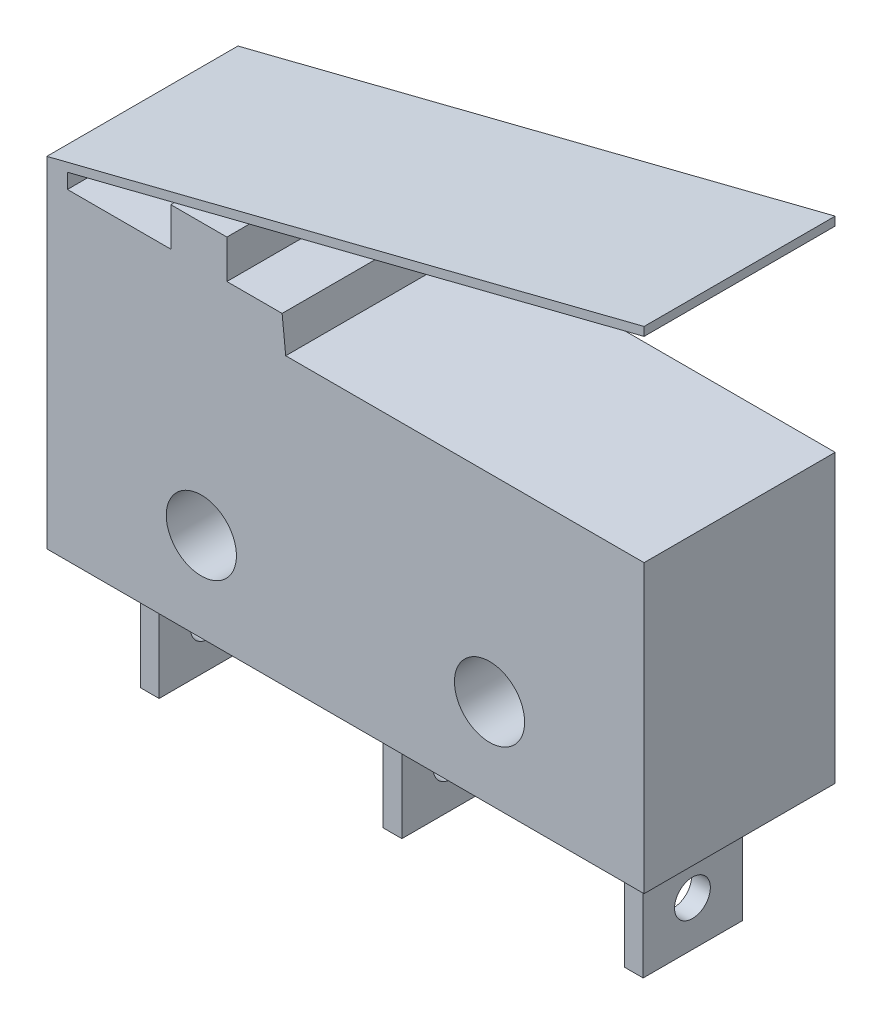
ISO-10303-21;
HEADER;
FILE_DESCRIPTION(('STEP AP214'),'2;1');
FILE_NAME('part.step','',(''),(''),'','','');
FILE_SCHEMA(('AUTOMOTIVE_DESIGN { 1 0 10303 214 1 1 1 1 }'));
ENDSEC;
DATA;
#1=APPLICATION_CONTEXT('core data for automotive mechanical design processes');
#2=APPLICATION_PROTOCOL_DEFINITION('international standard','automotive_design',2000,#1);
#3=PRODUCT_CONTEXT('',#1,'mechanical');
#4=PRODUCT('Part','Part','',(#3));
#5=PRODUCT_RELATED_PRODUCT_CATEGORY('part','',(#4));
#6=PRODUCT_DEFINITION_FORMATION('','',#4);
#7=PRODUCT_DEFINITION_CONTEXT('part definition',#1,'design');
#8=PRODUCT_DEFINITION('design','',#6,#7);
#9=PRODUCT_DEFINITION_SHAPE('','',#8);
#10=(LENGTH_UNIT() NAMED_UNIT(*) SI_UNIT(.MILLI.,.METRE.));
#11=(NAMED_UNIT(*) PLANE_ANGLE_UNIT() SI_UNIT($,.RADIAN.));
#12=(NAMED_UNIT(*) SI_UNIT($,.STERADIAN.) SOLID_ANGLE_UNIT());
#13=UNCERTAINTY_MEASURE_WITH_UNIT(LENGTH_MEASURE(1.E-05),#10,'distance_accuracy_value','');
#14=(GEOMETRIC_REPRESENTATION_CONTEXT(3) GLOBAL_UNCERTAINTY_ASSIGNED_CONTEXT((#13)) GLOBAL_UNIT_ASSIGNED_CONTEXT((#10,
#11,#12)) REPRESENTATION_CONTEXT('',''));
#15=CARTESIAN_POINT('',(0.,0.,0.));
#16=DIRECTION('',(0.,0.,1.));
#17=DIRECTION('',(1.,0.,0.));
#18=AXIS2_PLACEMENT_3D('',#15,#16,#17);
#19=CARTESIAN_POINT('',(1.36184855369967,21.0415924582425,6.4));
#20=DIRECTION('',(0.,1.,0.));
#21=DIRECTION('',(0.,0.,1.));
#22=AXIS2_PLACEMENT_3D('',#19,#20,#21);
#23=PLANE('',#22);
#24=DIRECTION('',(0.,0.,-1.));
#25=VECTOR('',#24,1.);
#26=CARTESIAN_POINT('',(11.0718485536997,21.0415924582425,1.52));
#27=LINE('',#26,#25);
#28=CARTESIAN_POINT('',(11.0718485536997,21.0415924582425,4.85));
#29=VERTEX_POINT('',#28);
#30=CARTESIAN_POINT('',(11.0718485536997,21.0415924582425,1.52));
#31=VERTEX_POINT('',#30);
#32=EDGE_CURVE('E229',#29,#31,#27,.T.);
#33=ORIENTED_EDGE('',*,*,#32,.F.);
#34=DIRECTION('',(-1.,0.,0.));
#35=VECTOR('',#34,1.);
#36=CARTESIAN_POINT('',(11.0718485536997,21.0415924582425,4.85));
#37=LINE('',#36,#35);
#38=CARTESIAN_POINT('',(11.7018485536997,21.0415924582425,4.85));
#39=VERTEX_POINT('',#38);
#40=EDGE_CURVE('E242',#39,#29,#37,.T.);
#41=ORIENTED_EDGE('',*,*,#40,.F.);
#42=DIRECTION('',(0.,0.,1.));
#43=VECTOR('',#42,1.);
#44=CARTESIAN_POINT('',(11.7018485536997,21.0415924582425,1.52));
#45=LINE('',#44,#43);
#46=CARTESIAN_POINT('',(11.7018485536997,21.0415924582425,1.52));
#47=VERTEX_POINT('',#46);
#48=EDGE_CURVE('E251',#47,#39,#45,.T.);
#49=ORIENTED_EDGE('',*,*,#48,.F.);
#50=DIRECTION('',(1.,0.,0.));
#51=VECTOR('',#50,1.);
#52=CARTESIAN_POINT('',(11.0718485536997,21.0415924582425,1.52));
#53=LINE('',#52,#51);
#54=EDGE_CURVE('E232',#31,#47,#53,.T.);
#55=ORIENTED_EDGE('',*,*,#54,.F.);
#56=EDGE_LOOP('',(#33,#41,#49,#55));
#57=FACE_BOUND('',#56,.T.);
#58=DIRECTION('',(1.,0.,0.));
#59=VECTOR('',#58,1.);
#60=CARTESIAN_POINT('',(1.36184855369967,21.0415924582425,0.));
#61=LINE('',#60,#59);
#62=CARTESIAN_POINT('',(1.36184855369967,21.0415924582425,0.));
#63=VERTEX_POINT('',#62);
#64=CARTESIAN_POINT('',(21.3618485536997,21.0415924582425,0.));
#65=VERTEX_POINT('',#64);
#66=EDGE_CURVE('E416',#63,#65,#61,.T.);
#67=ORIENTED_EDGE('',*,*,#66,.T.);
#68=DIRECTION('',(0.,0.,-1.));
#69=VECTOR('',#68,1.);
#70=CARTESIAN_POINT('',(21.3618485536997,21.0415924582425,6.4));
#71=LINE('',#70,#69);
#72=CARTESIAN_POINT('',(21.3618485536997,21.0415924582425,6.4));
#73=VERTEX_POINT('',#72);
#74=EDGE_CURVE('E42',#73,#65,#71,.T.);
#75=ORIENTED_EDGE('',*,*,#74,.F.);
#76=DIRECTION('',(1.,0.,0.));
#77=VECTOR('',#76,1.);
#78=CARTESIAN_POINT('',(1.36184855369967,21.0415924582425,6.4));
#79=LINE('',#78,#77);
#80=CARTESIAN_POINT('',(1.36184855369967,21.0415924582425,6.4));
#81=VERTEX_POINT('',#80);
#82=EDGE_CURVE('E414',#81,#73,#79,.T.);
#83=ORIENTED_EDGE('',*,*,#82,.F.);
#84=DIRECTION('',(0.,0.,-1.));
#85=VECTOR('',#84,1.);
#86=CARTESIAN_POINT('',(1.36184855369967,21.0415924582425,6.4));
#87=LINE('',#86,#85);
#88=EDGE_CURVE('E11',#81,#63,#87,.T.);
#89=ORIENTED_EDGE('',*,*,#88,.T.);
#90=EDGE_LOOP('',(#67,#75,#83,#89));
#91=FACE_BOUND('',#90,.T.);
#92=DIRECTION('',(0.,0.,-1.));
#93=VECTOR('',#92,1.);
#94=CARTESIAN_POINT('',(2.94184855369967,21.0415924582425,1.52));
#95=LINE('',#94,#93);
#96=CARTESIAN_POINT('',(2.94184855369967,21.0415924582425,4.85));
#97=VERTEX_POINT('',#96);
#98=CARTESIAN_POINT('',(2.94184855369967,21.0415924582425,1.52));
#99=VERTEX_POINT('',#98);
#100=EDGE_CURVE('E267',#97,#99,#95,.T.);
#101=ORIENTED_EDGE('',*,*,#100,.F.);
#102=DIRECTION('',(-1.,0.,0.));
#103=VECTOR('',#102,1.);
#104=CARTESIAN_POINT('',(2.94184855369967,21.0415924582425,4.85));
#105=LINE('',#104,#103);
#106=CARTESIAN_POINT('',(3.57184855369967,21.0415924582425,4.85));
#107=VERTEX_POINT('',#106);
#108=EDGE_CURVE('E272',#107,#97,#105,.T.);
#109=ORIENTED_EDGE('',*,*,#108,.F.);
#110=DIRECTION('',(0.,0.,1.));
#111=VECTOR('',#110,1.);
#112=CARTESIAN_POINT('',(3.57184855369967,21.0415924582425,1.52));
#113=LINE('',#112,#111);
#114=CARTESIAN_POINT('',(3.57184855369967,21.0415924582425,1.52));
#115=VERTEX_POINT('',#114);
#116=EDGE_CURVE('E284',#115,#107,#113,.T.);
#117=ORIENTED_EDGE('',*,*,#116,.F.);
#118=DIRECTION('',(1.,0.,0.));
#119=VECTOR('',#118,1.);
#120=CARTESIAN_POINT('',(2.94184855369967,21.0415924582425,1.52));
#121=LINE('',#120,#119);
#122=EDGE_CURVE('E281',#99,#115,#121,.T.);
#123=ORIENTED_EDGE('',*,*,#122,.F.);
#124=EDGE_LOOP('',(#101,#109,#117,#123));
#125=FACE_BOUND('',#124,.T.);
#126=DIRECTION('',(0.,0.,-1.));
#127=VECTOR('',#126,1.);
#128=CARTESIAN_POINT('',(19.1518485536997,21.0415924582425,1.52));
#129=LINE('',#128,#127);
#130=CARTESIAN_POINT('',(19.1518485536997,21.0415924582425,4.85));
#131=VERTEX_POINT('',#130);
#132=CARTESIAN_POINT('',(19.1518485536997,21.0415924582425,1.52));
#133=VERTEX_POINT('',#132);
#134=EDGE_CURVE('E228',#131,#133,#129,.T.);
#135=ORIENTED_EDGE('',*,*,#134,.F.);
#136=DIRECTION('',(-1.,0.,0.));
#137=VECTOR('',#136,1.);
#138=CARTESIAN_POINT('',(19.1518485536997,21.0415924582425,4.85));
#139=LINE('',#138,#137);
#140=CARTESIAN_POINT('',(19.7818485536997,21.0415924582425,4.85));
#141=VERTEX_POINT('',#140);
#142=EDGE_CURVE('E225',#141,#131,#139,.T.);
#143=ORIENTED_EDGE('',*,*,#142,.F.);
#144=DIRECTION('',(0.,0.,1.));
#145=VECTOR('',#144,1.);
#146=CARTESIAN_POINT('',(19.7818485536997,21.0415924582425,1.52));
#147=LINE('',#146,#145);
#148=CARTESIAN_POINT('',(19.7818485536997,21.0415924582425,1.52));
#149=VERTEX_POINT('',#148);
#150=EDGE_CURVE('E55',#149,#141,#147,.T.);
#151=ORIENTED_EDGE('',*,*,#150,.F.);
#152=DIRECTION('',(1.,0.,0.));
#153=VECTOR('',#152,1.);
#154=CARTESIAN_POINT('',(19.1518485536997,21.0415924582425,1.52));
#155=LINE('',#154,#153);
#156=EDGE_CURVE('E50',#133,#149,#155,.T.);
#157=ORIENTED_EDGE('',*,*,#156,.F.);
#158=EDGE_LOOP('',(#135,#143,#151,#157));
#159=FACE_BOUND('',#158,.T.);
#160=ADVANCED_FACE('F33',(#57,#91,#125,#159),#23,.F.);
#161=CARTESIAN_POINT('',(1.36184855369967,21.0415924582425,6.4));
#162=DIRECTION('',(1.,0.,0.));
#163=DIRECTION('',(0.,0.,-1.));
#164=AXIS2_PLACEMENT_3D('',#161,#162,#163);
#165=PLANE('',#164);
#166=DIRECTION('',(0.,-1.,0.));
#167=VECTOR('',#166,1.);
#168=CARTESIAN_POINT('',(1.36184855369967,21.0415924582425,0.));
#169=LINE('',#168,#167);
#170=CARTESIAN_POINT('',(1.36184855369967,32.4247301587282,0.));
#171=VERTEX_POINT('',#170);
#172=EDGE_CURVE('E435',#171,#63,#169,.T.);
#173=ORIENTED_EDGE('',*,*,#172,.T.);
#174=ORIENTED_EDGE('',*,*,#88,.F.);
#175=DIRECTION('',(0.,-1.,0.));
#176=VECTOR('',#175,1.);
#177=CARTESIAN_POINT('',(1.36184855369967,21.0415924582425,6.4));
#178=LINE('',#177,#176);
#179=CARTESIAN_POINT('',(1.36184855369967,32.4247301587282,6.4));
#180=VERTEX_POINT('',#179);
#181=EDGE_CURVE('E410',#180,#81,#178,.T.);
#182=ORIENTED_EDGE('',*,*,#181,.F.);
#183=DIRECTION('',(0.,0.,1.));
#184=VECTOR('',#183,1.);
#185=CARTESIAN_POINT('',(1.36184855369967,32.4247301587282,0.));
#186=LINE('',#185,#184);
#187=EDGE_CURVE('E357',#171,#180,#186,.T.);
#188=ORIENTED_EDGE('',*,*,#187,.F.);
#189=EDGE_LOOP('',(#173,#174,#182,#188));
#190=FACE_BOUND('',#189,.T.);
#191=ADVANCED_FACE('F35',(#190),#165,.F.);
#192=CARTESIAN_POINT('',(21.3618485536997,21.0415924582425,6.4));
#193=DIRECTION('',(-1.,0.,0.));
#194=DIRECTION('',(0.,0.,1.));
#195=AXIS2_PLACEMENT_3D('',#192,#193,#194);
#196=PLANE('',#195);
#197=DIRECTION('',(0.,1.,0.));
#198=VECTOR('',#197,1.);
#199=CARTESIAN_POINT('',(21.3618485536997,21.0415924582425,0.));
#200=LINE('',#199,#198);
#201=CARTESIAN_POINT('',(21.3618485536997,30.6415924582425,0.));
#202=VERTEX_POINT('',#201);
#203=EDGE_CURVE('E411',#65,#202,#200,.T.);
#204=ORIENTED_EDGE('',*,*,#203,.T.);
#205=DIRECTION('',(0.,0.,-1.));
#206=VECTOR('',#205,1.);
#207=CARTESIAN_POINT('',(21.3618485536997,30.6415924582425,6.4));
#208=LINE('',#207,#206);
#209=CARTESIAN_POINT('',(21.3618485536997,30.6415924582425,6.4));
#210=VERTEX_POINT('',#209);
#211=EDGE_CURVE('E409',#210,#202,#208,.T.);
#212=ORIENTED_EDGE('',*,*,#211,.F.);
#213=DIRECTION('',(0.,1.,0.));
#214=VECTOR('',#213,1.);
#215=CARTESIAN_POINT('',(21.3618485536997,21.0415924582425,6.4));
#216=LINE('',#215,#214);
#217=EDGE_CURVE('E431',#73,#210,#216,.T.);
#218=ORIENTED_EDGE('',*,*,#217,.F.);
#219=ORIENTED_EDGE('',*,*,#74,.T.);
#220=EDGE_LOOP('',(#204,#212,#218,#219));
#221=FACE_BOUND('',#220,.T.);
#222=ADVANCED_FACE('F430',(#221),#196,.F.);
#223=CARTESIAN_POINT('',(1.36184855369967,30.6415924582425,6.4));
#224=DIRECTION('',(0.,-1.,0.));
#225=DIRECTION('',(0.,0.,-1.));
#226=AXIS2_PLACEMENT_3D('',#223,#224,#225);
#227=PLANE('',#226);
#228=DIRECTION('',(-1.,0.,0.));
#229=VECTOR('',#228,1.);
#230=CARTESIAN_POINT('',(1.36184855369967,30.6415924582425,0.));
#231=LINE('',#230,#229);
#232=CARTESIAN_POINT('',(9.36184855369967,30.6415924582425,0.));
#233=VERTEX_POINT('',#232);
#234=EDGE_CURVE('E401',#202,#233,#231,.T.);
#235=ORIENTED_EDGE('',*,*,#234,.T.);
#236=DIRECTION('',(0.,0.,1.));
#237=VECTOR('',#236,1.);
#238=CARTESIAN_POINT('',(9.36184855369967,30.6415924582425,0.));
#239=LINE('',#238,#237);
#240=CARTESIAN_POINT('',(9.36184855369967,30.6415924582425,6.4));
#241=VERTEX_POINT('',#240);
#242=EDGE_CURVE('E329',#233,#241,#239,.T.);
#243=ORIENTED_EDGE('',*,*,#242,.T.);
#244=DIRECTION('',(-1.,0.,0.));
#245=VECTOR('',#244,1.);
#246=CARTESIAN_POINT('',(1.36184855369967,30.6415924582425,6.4));
#247=LINE('',#246,#245);
#248=EDGE_CURVE('E421',#210,#241,#247,.T.);
#249=ORIENTED_EDGE('',*,*,#248,.F.);
#250=ORIENTED_EDGE('',*,*,#211,.T.);
#251=EDGE_LOOP('',(#235,#243,#249,#250));
#252=FACE_BOUND('',#251,.T.);
#253=ADVANCED_FACE('F405',(#252),#227,.F.);
#254=CARTESIAN_POINT('',(1.36184855369967,30.6415924582425,6.4));
#255=DIRECTION('',(0.,0.,-1.));
#256=DIRECTION('',(-1.,0.,0.));
#257=AXIS2_PLACEMENT_3D('',#254,#255,#256);
#258=PLANE('',#257);
#259=CARTESIAN_POINT('',(6.53684855369967,24.0165924582425,6.4));
#260=DIRECTION('',(0.,0.,1.));
#261=DIRECTION('',(-1.,0.,0.));
#262=AXIS2_PLACEMENT_3D('',#259,#260,#261);
#263=CIRCLE('',#262,1.175);
#264=CARTESIAN_POINT('',(5.36184855369967,24.0165924582425,6.4));
#265=VERTEX_POINT('',#264);
#266=EDGE_CURVE('E360',#265,#265,#263,.T.);
#267=ORIENTED_EDGE('',*,*,#266,.F.);
#268=EDGE_LOOP('',(#267));
#269=FACE_BOUND('',#268,.T.);
#270=CARTESIAN_POINT('',(16.1868485536997,24.0165924582425,6.4));
#271=DIRECTION('',(0.,0.,1.));
#272=DIRECTION('',(1.,0.,0.));
#273=AXIS2_PLACEMENT_3D('',#270,#271,#272);
#274=CIRCLE('',#273,1.175);
#275=CARTESIAN_POINT('',(17.3618485536997,24.0165924582425,6.4));
#276=VERTEX_POINT('',#275);
#277=EDGE_CURVE('E443',#276,#276,#274,.T.);
#278=ORIENTED_EDGE('',*,*,#277,.F.);
#279=EDGE_LOOP('',(#278));
#280=FACE_BOUND('',#279,.T.);
#281=ORIENTED_EDGE('',*,*,#181,.T.);
#282=ORIENTED_EDGE('',*,*,#82,.T.);
#283=ORIENTED_EDGE('',*,*,#217,.T.);
#284=ORIENTED_EDGE('',*,*,#248,.T.);
#285=DIRECTION('',(-0.10271213899204,0.994711122137317,0.));
#286=VECTOR('',#285,1.);
#287=CARTESIAN_POINT('',(9.24123613001052,31.8096580879616,6.4));
#288=LINE('',#287,#286);
#289=CARTESIAN_POINT('',(9.24123613001052,31.8096580879616,6.4));
#290=VERTEX_POINT('',#289);
#291=EDGE_CURVE('E300',#241,#290,#288,.T.);
#292=ORIENTED_EDGE('',*,*,#291,.T.);
#293=DIRECTION('',(-1.,0.,0.));
#294=VECTOR('',#293,1.);
#295=CARTESIAN_POINT('',(7.39232550373456,31.8096580879616,6.4));
#296=LINE('',#295,#294);
#297=CARTESIAN_POINT('',(7.39232550373456,31.8096580879616,6.4));
#298=VERTEX_POINT('',#297);
#299=EDGE_CURVE('E330',#290,#298,#296,.T.);
#300=ORIENTED_EDGE('',*,*,#299,.T.);
#301=DIRECTION('',(0.,1.,0.));
#302=VECTOR('',#301,1.);
#303=CARTESIAN_POINT('',(7.39232550373456,33.0996580879616,6.4));
#304=LINE('',#303,#302);
#305=CARTESIAN_POINT('',(7.39232550373456,33.0996580879616,6.4));
#306=VERTEX_POINT('',#305);
#307=EDGE_CURVE('E333',#298,#306,#304,.T.);
#308=ORIENTED_EDGE('',*,*,#307,.T.);
#309=DIRECTION('',(-1.,0.,0.));
#310=VECTOR('',#309,1.);
#311=CARTESIAN_POINT('',(5.51232550373456,33.0996580879616,6.4));
#312=LINE('',#311,#310);
#313=CARTESIAN_POINT('',(5.51232550373456,33.0996580879616,6.4));
#314=VERTEX_POINT('',#313);
#315=EDGE_CURVE('E336',#306,#314,#312,.T.);
#316=ORIENTED_EDGE('',*,*,#315,.T.);
#317=DIRECTION('',(0.,-1.,0.));
#318=VECTOR('',#317,1.);
#319=CARTESIAN_POINT('',(5.51232550373456,31.8096580879616,6.4));
#320=LINE('',#319,#318);
#321=CARTESIAN_POINT('',(5.51232550373456,31.8096580879616,6.4));
#322=VERTEX_POINT('',#321);
#323=EDGE_CURVE('E339',#314,#322,#320,.T.);
#324=ORIENTED_EDGE('',*,*,#323,.T.);
#325=DIRECTION('',(-1.,0.,0.));
#326=VECTOR('',#325,1.);
#327=CARTESIAN_POINT('',(2.05232550373456,31.8096580879616,6.4));
#328=LINE('',#327,#326);
#329=CARTESIAN_POINT('',(2.05232550373456,31.8096580879616,6.4));
#330=VERTEX_POINT('',#329);
#331=EDGE_CURVE('E342',#322,#330,#328,.T.);
#332=ORIENTED_EDGE('',*,*,#331,.T.);
#333=DIRECTION('',(0.,1.,0.));
#334=VECTOR('',#333,1.);
#335=CARTESIAN_POINT('',(2.05232550373456,32.3096580879616,6.4));
#336=LINE('',#335,#334);
#337=CARTESIAN_POINT('',(2.05232550373456,32.3096580879616,6.4));
#338=VERTEX_POINT('',#337);
#339=EDGE_CURVE('E345',#330,#338,#336,.T.);
#340=ORIENTED_EDGE('',*,*,#339,.T.);
#341=DIRECTION('',(0.969375063805631,0.245584986658039,0.));
#342=VECTOR('',#341,1.);
#343=CARTESIAN_POINT('',(21.3618485536997,37.201602535121,6.4));
#344=LINE('',#343,#342);
#345=CARTESIAN_POINT('',(21.3618485536997,37.201602535121,6.4));
#346=VERTEX_POINT('',#345);
#347=EDGE_CURVE('E348',#338,#346,#344,.T.);
#348=ORIENTED_EDGE('',*,*,#347,.T.);
#349=DIRECTION('',(0.,1.,0.));
#350=VECTOR('',#349,1.);
#351=CARTESIAN_POINT('',(21.3618485536997,37.491602535121,6.4));
#352=LINE('',#351,#350);
#353=CARTESIAN_POINT('',(21.3618485536997,37.491602535121,6.4));
#354=VERTEX_POINT('',#353);
#355=EDGE_CURVE('E351',#346,#354,#352,.T.);
#356=ORIENTED_EDGE('',*,*,#355,.T.);
#357=DIRECTION('',(-0.969375063805631,-0.245584986658039,0.));
#358=VECTOR('',#357,1.);
#359=CARTESIAN_POINT('',(1.36184855369967,32.4247301587282,6.4));
#360=LINE('',#359,#358);
#361=EDGE_CURVE('E354',#354,#180,#360,.T.);
#362=ORIENTED_EDGE('',*,*,#361,.T.);
#363=EDGE_LOOP('',(#281,#282,#283,#284,#292,#300,#308,#316,#324,#332,#340,#348,#356,#362));
#364=FACE_BOUND('',#363,.T.);
#365=ADVANCED_FACE('F485',(#269,#280,#364),#258,.F.);
#366=CARTESIAN_POINT('',(1.36184855369967,30.6415924582425,0.));
#367=DIRECTION('',(0.,0.,-1.));
#368=DIRECTION('',(-1.,0.,0.));
#369=AXIS2_PLACEMENT_3D('',#366,#367,#368);
#370=PLANE('',#369);
#371=CARTESIAN_POINT('',(6.53684855369967,24.0165924582425,0.));
#372=DIRECTION('',(0.,0.,1.));
#373=DIRECTION('',(-1.,0.,0.));
#374=AXIS2_PLACEMENT_3D('',#371,#372,#373);
#375=CIRCLE('',#374,1.175);
#376=CARTESIAN_POINT('',(5.36184855369967,24.0165924582425,0.));
#377=VERTEX_POINT('',#376);
#378=EDGE_CURVE('E381',#377,#377,#375,.T.);
#379=ORIENTED_EDGE('',*,*,#378,.T.);
#380=EDGE_LOOP('',(#379));
#381=FACE_BOUND('',#380,.T.);
#382=CARTESIAN_POINT('',(16.1868485536997,24.0165924582425,0.));
#383=DIRECTION('',(0.,0.,1.));
#384=DIRECTION('',(1.,0.,0.));
#385=AXIS2_PLACEMENT_3D('',#382,#383,#384);
#386=CIRCLE('',#385,1.175);
#387=CARTESIAN_POINT('',(17.3618485536997,24.0165924582425,0.));
#388=VERTEX_POINT('',#387);
#389=EDGE_CURVE('E440',#388,#388,#386,.T.);
#390=ORIENTED_EDGE('',*,*,#389,.T.);
#391=EDGE_LOOP('',(#390));
#392=FACE_BOUND('',#391,.T.);
#393=ORIENTED_EDGE('',*,*,#172,.F.);
#394=DIRECTION('',(-0.969375063805631,-0.245584986658039,0.));
#395=VECTOR('',#394,1.);
#396=CARTESIAN_POINT('',(1.36184855369967,32.4247301587282,0.));
#397=LINE('',#396,#395);
#398=CARTESIAN_POINT('',(21.3618485536997,37.491602535121,0.));
#399=VERTEX_POINT('',#398);
#400=EDGE_CURVE('E326',#399,#171,#397,.T.);
#401=ORIENTED_EDGE('',*,*,#400,.F.);
#402=DIRECTION('',(0.,1.,0.));
#403=VECTOR('',#402,1.);
#404=CARTESIAN_POINT('',(21.3618485536997,37.491602535121,0.));
#405=LINE('',#404,#403);
#406=CARTESIAN_POINT('',(21.3618485536997,37.201602535121,0.));
#407=VERTEX_POINT('',#406);
#408=EDGE_CURVE('E323',#407,#399,#405,.T.);
#409=ORIENTED_EDGE('',*,*,#408,.F.);
#410=DIRECTION('',(0.969375063805631,0.245584986658039,0.));
#411=VECTOR('',#410,1.);
#412=CARTESIAN_POINT('',(21.3618485536997,37.201602535121,0.));
#413=LINE('',#412,#411);
#414=CARTESIAN_POINT('',(2.05232550373456,32.3096580879616,0.));
#415=VERTEX_POINT('',#414);
#416=EDGE_CURVE('E320',#415,#407,#413,.T.);
#417=ORIENTED_EDGE('',*,*,#416,.F.);
#418=DIRECTION('',(0.,1.,0.));
#419=VECTOR('',#418,1.);
#420=CARTESIAN_POINT('',(2.05232550373456,32.3096580879616,0.));
#421=LINE('',#420,#419);
#422=CARTESIAN_POINT('',(2.05232550373456,31.8096580879616,0.));
#423=VERTEX_POINT('',#422);
#424=EDGE_CURVE('E317',#423,#415,#421,.T.);
#425=ORIENTED_EDGE('',*,*,#424,.F.);
#426=DIRECTION('',(-1.,0.,0.));
#427=VECTOR('',#426,1.);
#428=CARTESIAN_POINT('',(2.05232550373456,31.8096580879616,0.));
#429=LINE('',#428,#427);
#430=CARTESIAN_POINT('',(5.51232550373456,31.8096580879616,0.));
#431=VERTEX_POINT('',#430);
#432=EDGE_CURVE('E314',#431,#423,#429,.T.);
#433=ORIENTED_EDGE('',*,*,#432,.F.);
#434=DIRECTION('',(0.,-1.,0.));
#435=VECTOR('',#434,1.);
#436=CARTESIAN_POINT('',(5.51232550373456,31.8096580879616,0.));
#437=LINE('',#436,#435);
#438=CARTESIAN_POINT('',(5.51232550373456,33.0996580879616,0.));
#439=VERTEX_POINT('',#438);
#440=EDGE_CURVE('E311',#439,#431,#437,.T.);
#441=ORIENTED_EDGE('',*,*,#440,.F.);
#442=DIRECTION('',(-1.,0.,0.));
#443=VECTOR('',#442,1.);
#444=CARTESIAN_POINT('',(5.51232550373456,33.0996580879616,0.));
#445=LINE('',#444,#443);
#446=CARTESIAN_POINT('',(7.39232550373456,33.0996580879616,0.));
#447=VERTEX_POINT('',#446);
#448=EDGE_CURVE('E308',#447,#439,#445,.T.);
#449=ORIENTED_EDGE('',*,*,#448,.F.);
#450=DIRECTION('',(0.,1.,0.));
#451=VECTOR('',#450,1.);
#452=CARTESIAN_POINT('',(7.39232550373456,33.0996580879616,0.));
#453=LINE('',#452,#451);
#454=CARTESIAN_POINT('',(7.39232550373456,31.8096580879616,0.));
#455=VERTEX_POINT('',#454);
#456=EDGE_CURVE('E304',#455,#447,#453,.T.);
#457=ORIENTED_EDGE('',*,*,#456,.F.);
#458=DIRECTION('',(-1.,0.,0.));
#459=VECTOR('',#458,1.);
#460=CARTESIAN_POINT('',(7.39232550373456,31.8096580879616,0.));
#461=LINE('',#460,#459);
#462=CARTESIAN_POINT('',(9.24123613001052,31.8096580879616,0.));
#463=VERTEX_POINT('',#462);
#464=EDGE_CURVE('E301',#463,#455,#461,.T.);
#465=ORIENTED_EDGE('',*,*,#464,.F.);
#466=DIRECTION('',(-0.10271213899204,0.994711122137317,0.));
#467=VECTOR('',#466,1.);
#468=CARTESIAN_POINT('',(9.24123613001052,31.8096580879616,0.));
#469=LINE('',#468,#467);
#470=EDGE_CURVE('E305',#233,#463,#469,.T.);
#471=ORIENTED_EDGE('',*,*,#470,.F.);
#472=ORIENTED_EDGE('',*,*,#234,.F.);
#473=ORIENTED_EDGE('',*,*,#203,.F.);
#474=ORIENTED_EDGE('',*,*,#66,.F.);
#475=EDGE_LOOP('',(#393,#401,#409,#417,#425,#433,#441,#449,#457,#465,#471,#472,#473,#474));
#476=FACE_BOUND('',#475,.T.);
#477=ADVANCED_FACE('F399',(#381,#392,#476),#370,.T.);
#478=CARTESIAN_POINT('',(16.1868485536997,24.0165924582425,0.));
#479=DIRECTION('',(0.,0.,1.));
#480=DIRECTION('',(1.,0.,0.));
#481=AXIS2_PLACEMENT_3D('',#478,#479,#480);
#482=CYLINDRICAL_SURFACE('',#481,1.175);
#483=ORIENTED_EDGE('',*,*,#389,.F.);
#484=EDGE_LOOP('',(#483));
#485=FACE_BOUND('',#484,.T.);
#486=ORIENTED_EDGE('',*,*,#277,.T.);
#487=EDGE_LOOP('',(#486));
#488=FACE_BOUND('',#487,.T.);
#489=ADVANCED_FACE('F461',(#485,#488),#482,.F.);
#490=CARTESIAN_POINT('',(6.53684855369967,24.0165924582425,0.));
#491=DIRECTION('',(0.,0.,1.));
#492=DIRECTION('',(1.,0.,0.));
#493=AXIS2_PLACEMENT_3D('',#490,#491,#492);
#494=CYLINDRICAL_SURFACE('',#493,1.175);
#495=ORIENTED_EDGE('',*,*,#378,.F.);
#496=EDGE_LOOP('',(#495));
#497=FACE_BOUND('',#496,.T.);
#498=ORIENTED_EDGE('',*,*,#266,.T.);
#499=EDGE_LOOP('',(#498));
#500=FACE_BOUND('',#499,.T.);
#501=ADVANCED_FACE('F458',(#497,#500),#494,.F.);
#502=CARTESIAN_POINT('',(1.36184855369967,32.4247301587282,0.));
#503=DIRECTION('',(-0.245584986658039,0.969375063805631,0.));
#504=DIRECTION('',(-0.969375063805631,-0.245584986658039,0.));
#505=AXIS2_PLACEMENT_3D('',#502,#503,#504);
#506=PLANE('',#505);
#507=ORIENTED_EDGE('',*,*,#361,.F.);
#508=DIRECTION('',(0.,0.,1.));
#509=VECTOR('',#508,1.);
#510=CARTESIAN_POINT('',(21.3618485536997,37.491602535121,0.));
#511=LINE('',#510,#509);
#512=EDGE_CURVE('E361',#399,#354,#511,.T.);
#513=ORIENTED_EDGE('',*,*,#512,.F.);
#514=ORIENTED_EDGE('',*,*,#400,.T.);
#515=ORIENTED_EDGE('',*,*,#187,.T.);
#516=EDGE_LOOP('',(#507,#513,#514,#515));
#517=FACE_BOUND('',#516,.T.);
#518=ADVANCED_FACE('F460',(#517),#506,.T.);
#519=CARTESIAN_POINT('',(21.3618485536997,37.491602535121,0.));
#520=DIRECTION('',(1.,0.,0.));
#521=DIRECTION('',(0.,0.,-1.));
#522=AXIS2_PLACEMENT_3D('',#519,#520,#521);
#523=PLANE('',#522);
#524=ORIENTED_EDGE('',*,*,#355,.F.);
#525=DIRECTION('',(0.,0.,1.));
#526=VECTOR('',#525,1.);
#527=CARTESIAN_POINT('',(21.3618485536997,37.201602535121,0.));
#528=LINE('',#527,#526);
#529=EDGE_CURVE('E363',#407,#346,#528,.T.);
#530=ORIENTED_EDGE('',*,*,#529,.F.);
#531=ORIENTED_EDGE('',*,*,#408,.T.);
#532=ORIENTED_EDGE('',*,*,#512,.T.);
#533=EDGE_LOOP('',(#524,#530,#531,#532));
#534=FACE_BOUND('',#533,.T.);
#535=ADVANCED_FACE('F467',(#534),#523,.T.);
#536=CARTESIAN_POINT('',(21.3618485536997,37.201602535121,0.));
#537=DIRECTION('',(0.245584986658039,-0.969375063805631,0.));
#538=DIRECTION('',(0.969375063805631,0.245584986658039,0.));
#539=AXIS2_PLACEMENT_3D('',#536,#537,#538);
#540=PLANE('',#539);
#541=ORIENTED_EDGE('',*,*,#347,.F.);
#542=DIRECTION('',(0.,0.,1.));
#543=VECTOR('',#542,1.);
#544=CARTESIAN_POINT('',(2.05232550373456,32.3096580879616,0.));
#545=LINE('',#544,#543);
#546=EDGE_CURVE('E365',#415,#338,#545,.T.);
#547=ORIENTED_EDGE('',*,*,#546,.F.);
#548=ORIENTED_EDGE('',*,*,#416,.T.);
#549=ORIENTED_EDGE('',*,*,#529,.T.);
#550=EDGE_LOOP('',(#541,#547,#548,#549));
#551=FACE_BOUND('',#550,.T.);
#552=ADVANCED_FACE('F502',(#551),#540,.T.);
#553=CARTESIAN_POINT('',(2.05232550373456,32.3096580879616,0.));
#554=DIRECTION('',(1.,0.,0.));
#555=DIRECTION('',(0.,1.,0.));
#556=AXIS2_PLACEMENT_3D('',#553,#554,#555);
#557=PLANE('',#556);
#558=ORIENTED_EDGE('',*,*,#339,.F.);
#559=DIRECTION('',(0.,0.,1.));
#560=VECTOR('',#559,1.);
#561=CARTESIAN_POINT('',(2.05232550373456,31.8096580879616,0.));
#562=LINE('',#561,#560);
#563=EDGE_CURVE('E367',#423,#330,#562,.T.);
#564=ORIENTED_EDGE('',*,*,#563,.F.);
#565=ORIENTED_EDGE('',*,*,#424,.T.);
#566=ORIENTED_EDGE('',*,*,#546,.T.);
#567=EDGE_LOOP('',(#558,#564,#565,#566));
#568=FACE_BOUND('',#567,.T.);
#569=ADVANCED_FACE('F507',(#568),#557,.T.);
#570=CARTESIAN_POINT('',(2.05232550373456,31.8096580879616,0.));
#571=DIRECTION('',(0.,1.,0.));
#572=DIRECTION('',(0.,0.,1.));
#573=AXIS2_PLACEMENT_3D('',#570,#571,#572);
#574=PLANE('',#573);
#575=ORIENTED_EDGE('',*,*,#331,.F.);
#576=DIRECTION('',(0.,0.,1.));
#577=VECTOR('',#576,1.);
#578=CARTESIAN_POINT('',(5.51232550373456,31.8096580879616,0.));
#579=LINE('',#578,#577);
#580=EDGE_CURVE('E369',#431,#322,#579,.T.);
#581=ORIENTED_EDGE('',*,*,#580,.F.);
#582=ORIENTED_EDGE('',*,*,#432,.T.);
#583=ORIENTED_EDGE('',*,*,#563,.T.);
#584=EDGE_LOOP('',(#575,#581,#582,#583));
#585=FACE_BOUND('',#584,.T.);
#586=ADVANCED_FACE('F510',(#585),#574,.T.);
#587=CARTESIAN_POINT('',(5.51232550373456,31.8096580879616,0.));
#588=DIRECTION('',(-1.,0.,0.));
#589=DIRECTION('',(0.,0.,1.));
#590=AXIS2_PLACEMENT_3D('',#587,#588,#589);
#591=PLANE('',#590);
#592=ORIENTED_EDGE('',*,*,#323,.F.);
#593=DIRECTION('',(0.,0.,1.));
#594=VECTOR('',#593,1.);
#595=CARTESIAN_POINT('',(5.51232550373456,33.0996580879616,0.));
#596=LINE('',#595,#594);
#597=EDGE_CURVE('E371',#439,#314,#596,.T.);
#598=ORIENTED_EDGE('',*,*,#597,.F.);
#599=ORIENTED_EDGE('',*,*,#440,.T.);
#600=ORIENTED_EDGE('',*,*,#580,.T.);
#601=EDGE_LOOP('',(#592,#598,#599,#600));
#602=FACE_BOUND('',#601,.T.);
#603=ADVANCED_FACE('F515',(#602),#591,.T.);
#604=CARTESIAN_POINT('',(5.51232550373456,33.0996580879616,0.));
#605=DIRECTION('',(0.,1.,0.));
#606=DIRECTION('',(0.,0.,1.));
#607=AXIS2_PLACEMENT_3D('',#604,#605,#606);
#608=PLANE('',#607);
#609=ORIENTED_EDGE('',*,*,#315,.F.);
#610=DIRECTION('',(0.,0.,1.));
#611=VECTOR('',#610,1.);
#612=CARTESIAN_POINT('',(7.39232550373456,33.0996580879616,0.));
#613=LINE('',#612,#611);
#614=EDGE_CURVE('E373',#447,#306,#613,.T.);
#615=ORIENTED_EDGE('',*,*,#614,.F.);
#616=ORIENTED_EDGE('',*,*,#448,.T.);
#617=ORIENTED_EDGE('',*,*,#597,.T.);
#618=EDGE_LOOP('',(#609,#615,#616,#617));
#619=FACE_BOUND('',#618,.T.);
#620=ADVANCED_FACE('F518',(#619),#608,.T.);
#621=CARTESIAN_POINT('',(7.39232550373456,33.0996580879616,0.));
#622=DIRECTION('',(1.,0.,0.));
#623=DIRECTION('',(0.,1.,0.));
#624=AXIS2_PLACEMENT_3D('',#621,#622,#623);
#625=PLANE('',#624);
#626=ORIENTED_EDGE('',*,*,#307,.F.);
#627=DIRECTION('',(0.,0.,1.));
#628=VECTOR('',#627,1.);
#629=CARTESIAN_POINT('',(7.39232550373456,31.8096580879616,0.));
#630=LINE('',#629,#628);
#631=EDGE_CURVE('E375',#455,#298,#630,.T.);
#632=ORIENTED_EDGE('',*,*,#631,.F.);
#633=ORIENTED_EDGE('',*,*,#456,.T.);
#634=ORIENTED_EDGE('',*,*,#614,.T.);
#635=EDGE_LOOP('',(#626,#632,#633,#634));
#636=FACE_BOUND('',#635,.T.);
#637=ADVANCED_FACE('F521',(#636),#625,.T.);
#638=CARTESIAN_POINT('',(7.39232550373456,31.8096580879616,0.));
#639=DIRECTION('',(0.,1.,0.));
#640=DIRECTION('',(0.,0.,1.));
#641=AXIS2_PLACEMENT_3D('',#638,#639,#640);
#642=PLANE('',#641);
#643=ORIENTED_EDGE('',*,*,#299,.F.);
#644=DIRECTION('',(0.,0.,1.));
#645=VECTOR('',#644,1.);
#646=CARTESIAN_POINT('',(9.24123613001052,31.8096580879616,0.));
#647=LINE('',#646,#645);
#648=EDGE_CURVE('E377',#463,#290,#647,.T.);
#649=ORIENTED_EDGE('',*,*,#648,.F.);
#650=ORIENTED_EDGE('',*,*,#464,.T.);
#651=ORIENTED_EDGE('',*,*,#631,.T.);
#652=EDGE_LOOP('',(#643,#649,#650,#651));
#653=FACE_BOUND('',#652,.T.);
#654=ADVANCED_FACE('F523',(#653),#642,.T.);
#655=CARTESIAN_POINT('',(9.24123613001052,31.8096580879616,0.));
#656=DIRECTION('',(0.994711122137317,0.10271213899204,0.));
#657=DIRECTION('',(-0.10271213899204,0.994711122137317,0.));
#658=AXIS2_PLACEMENT_3D('',#655,#656,#657);
#659=PLANE('',#658);
#660=ORIENTED_EDGE('',*,*,#291,.F.);
#661=ORIENTED_EDGE('',*,*,#242,.F.);
#662=ORIENTED_EDGE('',*,*,#470,.T.);
#663=ORIENTED_EDGE('',*,*,#648,.T.);
#664=EDGE_LOOP('',(#660,#661,#662,#663));
#665=FACE_BOUND('',#664,.T.);
#666=ADVANCED_FACE('F393',(#665),#659,.T.);
#667=CARTESIAN_POINT('',(2.94184855369967,17.0315924582425,1.52));
#668=DIRECTION('',(1.,0.,0.));
#669=DIRECTION('',(0.,0.,-1.));
#670=AXIS2_PLACEMENT_3D('',#667,#668,#669);
#671=PLANE('',#670);
#672=CARTESIAN_POINT('',(2.94184855369967,18.5315924582425,3.2));
#673=DIRECTION('',(-1.,0.,0.));
#674=DIRECTION('',(0.,0.,1.));
#675=AXIS2_PLACEMENT_3D('',#672,#673,#674);
#676=CIRCLE('',#675,0.6);
#677=CARTESIAN_POINT('',(2.94184855369967,18.5315924582425,3.8));
#678=VERTEX_POINT('',#677);
#679=EDGE_CURVE('E626',#678,#678,#676,.T.);
#680=ORIENTED_EDGE('',*,*,#679,.F.);
#681=EDGE_LOOP('',(#680));
#682=FACE_BOUND('',#681,.T.);
#683=ORIENTED_EDGE('',*,*,#100,.T.);
#684=DIRECTION('',(0.,1.,0.));
#685=VECTOR('',#684,1.);
#686=CARTESIAN_POINT('',(2.94184855369967,17.0315924582425,1.52));
#687=LINE('',#686,#685);
#688=CARTESIAN_POINT('',(2.94184855369967,17.0315924582425,1.52));
#689=VERTEX_POINT('',#688);
#690=EDGE_CURVE('E297',#689,#99,#687,.T.);
#691=ORIENTED_EDGE('',*,*,#690,.F.);
#692=DIRECTION('',(0.,0.,-1.));
#693=VECTOR('',#692,1.);
#694=CARTESIAN_POINT('',(2.94184855369967,17.0315924582425,1.52));
#695=LINE('',#694,#693);
#696=CARTESIAN_POINT('',(2.94184855369967,17.0315924582425,4.85));
#697=VERTEX_POINT('',#696);
#698=EDGE_CURVE('E268',#697,#689,#695,.T.);
#699=ORIENTED_EDGE('',*,*,#698,.F.);
#700=DIRECTION('',(0.,1.,0.));
#701=VECTOR('',#700,1.);
#702=CARTESIAN_POINT('',(2.94184855369967,17.0315924582425,4.85));
#703=LINE('',#702,#701);
#704=EDGE_CURVE('E278',#697,#97,#703,.T.);
#705=ORIENTED_EDGE('',*,*,#704,.T.);
#706=EDGE_LOOP('',(#683,#691,#699,#705));
#707=FACE_BOUND('',#706,.T.);
#708=ADVANCED_FACE('F531',(#682,#707),#671,.F.);
#709=CARTESIAN_POINT('',(2.94184855369967,17.0315924582425,1.52));
#710=DIRECTION('',(0.,0.,1.));
#711=DIRECTION('',(1.,0.,0.));
#712=AXIS2_PLACEMENT_3D('',#709,#710,#711);
#713=PLANE('',#712);
#714=ORIENTED_EDGE('',*,*,#122,.T.);
#715=DIRECTION('',(0.,1.,0.));
#716=VECTOR('',#715,1.);
#717=CARTESIAN_POINT('',(3.57184855369967,17.0315924582425,1.52));
#718=LINE('',#717,#716);
#719=CARTESIAN_POINT('',(3.57184855369967,17.0315924582425,1.52));
#720=VERTEX_POINT('',#719);
#721=EDGE_CURVE('E294',#720,#115,#718,.T.);
#722=ORIENTED_EDGE('',*,*,#721,.F.);
#723=DIRECTION('',(1.,0.,0.));
#724=VECTOR('',#723,1.);
#725=CARTESIAN_POINT('',(2.94184855369967,17.0315924582425,1.52));
#726=LINE('',#725,#724);
#727=EDGE_CURVE('E271',#689,#720,#726,.T.);
#728=ORIENTED_EDGE('',*,*,#727,.F.);
#729=ORIENTED_EDGE('',*,*,#690,.T.);
#730=EDGE_LOOP('',(#714,#722,#728,#729));
#731=FACE_BOUND('',#730,.T.);
#732=ADVANCED_FACE('F548',(#731),#713,.F.);
#733=CARTESIAN_POINT('',(3.57184855369967,17.0315924582425,1.52));
#734=DIRECTION('',(-1.,0.,0.));
#735=DIRECTION('',(0.,0.,1.));
#736=AXIS2_PLACEMENT_3D('',#733,#734,#735);
#737=PLANE('',#736);
#738=CARTESIAN_POINT('',(3.57184855369967,18.5315924582425,3.2));
#739=DIRECTION('',(-1.,0.,0.));
#740=DIRECTION('',(0.,0.,1.));
#741=AXIS2_PLACEMENT_3D('',#738,#739,#740);
#742=CIRCLE('',#741,0.6);
#743=CARTESIAN_POINT('',(3.57184855369967,18.5315924582425,3.8));
#744=VERTEX_POINT('',#743);
#745=EDGE_CURVE('E631',#744,#744,#742,.T.);
#746=ORIENTED_EDGE('',*,*,#745,.T.);
#747=EDGE_LOOP('',(#746));
#748=FACE_BOUND('',#747,.T.);
#749=ORIENTED_EDGE('',*,*,#116,.T.);
#750=DIRECTION('',(0.,1.,0.));
#751=VECTOR('',#750,1.);
#752=CARTESIAN_POINT('',(3.57184855369967,17.0315924582425,4.85));
#753=LINE('',#752,#751);
#754=CARTESIAN_POINT('',(3.57184855369967,17.0315924582425,4.85));
#755=VERTEX_POINT('',#754);
#756=EDGE_CURVE('E291',#755,#107,#753,.T.);
#757=ORIENTED_EDGE('',*,*,#756,.F.);
#758=DIRECTION('',(0.,0.,1.));
#759=VECTOR('',#758,1.);
#760=CARTESIAN_POINT('',(3.57184855369967,17.0315924582425,1.52));
#761=LINE('',#760,#759);
#762=EDGE_CURVE('E274',#720,#755,#761,.T.);
#763=ORIENTED_EDGE('',*,*,#762,.F.);
#764=ORIENTED_EDGE('',*,*,#721,.T.);
#765=EDGE_LOOP('',(#749,#757,#763,#764));
#766=FACE_BOUND('',#765,.T.);
#767=ADVANCED_FACE('F552',(#748,#766),#737,.F.);
#768=CARTESIAN_POINT('',(2.94184855369967,17.0315924582425,4.85));
#769=DIRECTION('',(0.,0.,-1.));
#770=DIRECTION('',(-1.,0.,0.));
#771=AXIS2_PLACEMENT_3D('',#768,#769,#770);
#772=PLANE('',#771);
#773=ORIENTED_EDGE('',*,*,#108,.T.);
#774=ORIENTED_EDGE('',*,*,#704,.F.);
#775=DIRECTION('',(-1.,0.,0.));
#776=VECTOR('',#775,1.);
#777=CARTESIAN_POINT('',(2.94184855369967,17.0315924582425,4.85));
#778=LINE('',#777,#776);
#779=EDGE_CURVE('E276',#755,#697,#778,.T.);
#780=ORIENTED_EDGE('',*,*,#779,.F.);
#781=ORIENTED_EDGE('',*,*,#756,.T.);
#782=EDGE_LOOP('',(#773,#774,#780,#781));
#783=FACE_BOUND('',#782,.T.);
#784=ADVANCED_FACE('F556',(#783),#772,.F.);
#785=CARTESIAN_POINT('',(2.94184855369967,17.0315924582425,4.85));
#786=DIRECTION('',(0.,1.,0.));
#787=DIRECTION('',(0.,0.,1.));
#788=AXIS2_PLACEMENT_3D('',#785,#786,#787);
#789=PLANE('',#788);
#790=ORIENTED_EDGE('',*,*,#698,.T.);
#791=ORIENTED_EDGE('',*,*,#727,.T.);
#792=ORIENTED_EDGE('',*,*,#762,.T.);
#793=ORIENTED_EDGE('',*,*,#779,.T.);
#794=EDGE_LOOP('',(#790,#791,#792,#793));
#795=FACE_BOUND('',#794,.T.);
#796=ADVANCED_FACE('F560',(#795),#789,.F.);
#797=CARTESIAN_POINT('',(11.0718485536997,17.0315924582425,1.52));
#798=DIRECTION('',(1.,0.,0.));
#799=DIRECTION('',(0.,0.,-1.));
#800=AXIS2_PLACEMENT_3D('',#797,#798,#799);
#801=PLANE('',#800);
#802=CARTESIAN_POINT('',(11.0718485536997,18.5315924582425,3.2));
#803=DIRECTION('',(1.,0.,0.));
#804=DIRECTION('',(0.,0.,-1.));
#805=AXIS2_PLACEMENT_3D('',#802,#803,#804);
#806=CIRCLE('',#805,0.6);
#807=CARTESIAN_POINT('',(11.0718485536997,18.5315924582425,2.6));
#808=VERTEX_POINT('',#807);
#809=EDGE_CURVE('E624',#808,#808,#806,.T.);
#810=ORIENTED_EDGE('',*,*,#809,.T.);
#811=EDGE_LOOP('',(#810));
#812=FACE_BOUND('',#811,.T.);
#813=ORIENTED_EDGE('',*,*,#32,.T.);
#814=DIRECTION('',(0.,1.,0.));
#815=VECTOR('',#814,1.);
#816=CARTESIAN_POINT('',(11.0718485536997,17.0315924582425,1.52));
#817=LINE('',#816,#815);
#818=CARTESIAN_POINT('',(11.0718485536997,17.0315924582425,1.52));
#819=VERTEX_POINT('',#818);
#820=EDGE_CURVE('E264',#819,#31,#817,.T.);
#821=ORIENTED_EDGE('',*,*,#820,.F.);
#822=DIRECTION('',(0.,0.,-1.));
#823=VECTOR('',#822,1.);
#824=CARTESIAN_POINT('',(11.0718485536997,17.0315924582425,1.52));
#825=LINE('',#824,#823);
#826=CARTESIAN_POINT('',(11.0718485536997,17.0315924582425,4.85));
#827=VERTEX_POINT('',#826);
#828=EDGE_CURVE('E238',#827,#819,#825,.T.);
#829=ORIENTED_EDGE('',*,*,#828,.F.);
#830=DIRECTION('',(0.,1.,0.));
#831=VECTOR('',#830,1.);
#832=CARTESIAN_POINT('',(11.0718485536997,17.0315924582425,4.85));
#833=LINE('',#832,#831);
#834=EDGE_CURVE('E247',#827,#29,#833,.T.);
#835=ORIENTED_EDGE('',*,*,#834,.T.);
#836=EDGE_LOOP('',(#813,#821,#829,#835));
#837=FACE_BOUND('',#836,.T.);
#838=ADVANCED_FACE('F564',(#812,#837),#801,.F.);
#839=CARTESIAN_POINT('',(11.0718485536997,17.0315924582425,1.52));
#840=DIRECTION('',(0.,0.,1.));
#841=DIRECTION('',(1.,0.,0.));
#842=AXIS2_PLACEMENT_3D('',#839,#840,#841);
#843=PLANE('',#842);
#844=ORIENTED_EDGE('',*,*,#54,.T.);
#845=DIRECTION('',(0.,1.,0.));
#846=VECTOR('',#845,1.);
#847=CARTESIAN_POINT('',(11.7018485536997,17.0315924582425,1.52));
#848=LINE('',#847,#846);
#849=CARTESIAN_POINT('',(11.7018485536997,17.0315924582425,1.52));
#850=VERTEX_POINT('',#849);
#851=EDGE_CURVE('E261',#850,#47,#848,.T.);
#852=ORIENTED_EDGE('',*,*,#851,.F.);
#853=DIRECTION('',(1.,0.,0.));
#854=VECTOR('',#853,1.);
#855=CARTESIAN_POINT('',(11.0718485536997,17.0315924582425,1.52));
#856=LINE('',#855,#854);
#857=EDGE_CURVE('E241',#819,#850,#856,.T.);
#858=ORIENTED_EDGE('',*,*,#857,.F.);
#859=ORIENTED_EDGE('',*,*,#820,.T.);
#860=EDGE_LOOP('',(#844,#852,#858,#859));
#861=FACE_BOUND('',#860,.T.);
#862=ADVANCED_FACE('F568',(#861),#843,.F.);
#863=CARTESIAN_POINT('',(11.7018485536997,17.0315924582425,1.52));
#864=DIRECTION('',(-1.,0.,0.));
#865=DIRECTION('',(0.,0.,1.));
#866=AXIS2_PLACEMENT_3D('',#863,#864,#865);
#867=PLANE('',#866);
#868=CARTESIAN_POINT('',(11.7018485536997,18.5315924582425,3.2));
#869=DIRECTION('',(-1.,0.,0.));
#870=DIRECTION('',(0.,0.,1.));
#871=AXIS2_PLACEMENT_3D('',#868,#869,#870);
#872=CIRCLE('',#871,0.6);
#873=CARTESIAN_POINT('',(11.7018485536997,18.5315924582425,3.8));
#874=VERTEX_POINT('',#873);
#875=EDGE_CURVE('E621',#874,#874,#872,.T.);
#876=ORIENTED_EDGE('',*,*,#875,.T.);
#877=EDGE_LOOP('',(#876));
#878=FACE_BOUND('',#877,.T.);
#879=ORIENTED_EDGE('',*,*,#48,.T.);
#880=DIRECTION('',(0.,1.,0.));
#881=VECTOR('',#880,1.);
#882=CARTESIAN_POINT('',(11.7018485536997,17.0315924582425,4.85));
#883=LINE('',#882,#881);
#884=CARTESIAN_POINT('',(11.7018485536997,17.0315924582425,4.85));
#885=VERTEX_POINT('',#884);
#886=EDGE_CURVE('E258',#885,#39,#883,.T.);
#887=ORIENTED_EDGE('',*,*,#886,.F.);
#888=DIRECTION('',(0.,0.,1.));
#889=VECTOR('',#888,1.);
#890=CARTESIAN_POINT('',(11.7018485536997,17.0315924582425,1.52));
#891=LINE('',#890,#889);
#892=EDGE_CURVE('E244',#850,#885,#891,.T.);
#893=ORIENTED_EDGE('',*,*,#892,.F.);
#894=ORIENTED_EDGE('',*,*,#851,.T.);
#895=EDGE_LOOP('',(#879,#887,#893,#894));
#896=FACE_BOUND('',#895,.T.);
#897=ADVANCED_FACE('F572',(#878,#896),#867,.F.);
#898=CARTESIAN_POINT('',(11.0718485536997,17.0315924582425,4.85));
#899=DIRECTION('',(0.,0.,-1.));
#900=DIRECTION('',(-1.,0.,0.));
#901=AXIS2_PLACEMENT_3D('',#898,#899,#900);
#902=PLANE('',#901);
#903=ORIENTED_EDGE('',*,*,#40,.T.);
#904=ORIENTED_EDGE('',*,*,#834,.F.);
#905=DIRECTION('',(-1.,0.,0.));
#906=VECTOR('',#905,1.);
#907=CARTESIAN_POINT('',(11.0718485536997,17.0315924582425,4.85));
#908=LINE('',#907,#906);
#909=EDGE_CURVE('E246',#885,#827,#908,.T.);
#910=ORIENTED_EDGE('',*,*,#909,.F.);
#911=ORIENTED_EDGE('',*,*,#886,.T.);
#912=EDGE_LOOP('',(#903,#904,#910,#911));
#913=FACE_BOUND('',#912,.T.);
#914=ADVANCED_FACE('F576',(#913),#902,.F.);
#915=CARTESIAN_POINT('',(11.0718485536997,17.0315924582425,4.85));
#916=DIRECTION('',(0.,1.,0.));
#917=DIRECTION('',(0.,0.,1.));
#918=AXIS2_PLACEMENT_3D('',#915,#916,#917);
#919=PLANE('',#918);
#920=ORIENTED_EDGE('',*,*,#828,.T.);
#921=ORIENTED_EDGE('',*,*,#857,.T.);
#922=ORIENTED_EDGE('',*,*,#892,.T.);
#923=ORIENTED_EDGE('',*,*,#909,.T.);
#924=EDGE_LOOP('',(#920,#921,#922,#923));
#925=FACE_BOUND('',#924,.T.);
#926=ADVANCED_FACE('F580',(#925),#919,.F.);
#927=CARTESIAN_POINT('',(19.1518485536997,17.0315924582425,1.52));
#928=DIRECTION('',(1.,0.,0.));
#929=DIRECTION('',(0.,0.,-1.));
#930=AXIS2_PLACEMENT_3D('',#927,#928,#929);
#931=PLANE('',#930);
#932=CARTESIAN_POINT('',(19.1518485536997,18.5315924582425,3.2));
#933=DIRECTION('',(1.,0.,0.));
#934=DIRECTION('',(0.,0.,-1.));
#935=AXIS2_PLACEMENT_3D('',#932,#933,#934);
#936=CIRCLE('',#935,0.6);
#937=CARTESIAN_POINT('',(19.1518485536997,18.5315924582425,2.6));
#938=VERTEX_POINT('',#937);
#939=EDGE_CURVE('E620',#938,#938,#936,.T.);
#940=ORIENTED_EDGE('',*,*,#939,.T.);
#941=EDGE_LOOP('',(#940));
#942=FACE_BOUND('',#941,.T.);
#943=ORIENTED_EDGE('',*,*,#134,.T.);
#944=DIRECTION('',(0.,1.,0.));
#945=VECTOR('',#944,1.);
#946=CARTESIAN_POINT('',(19.1518485536997,17.0315924582425,1.52));
#947=LINE('',#946,#945);
#948=CARTESIAN_POINT('',(19.1518485536997,17.0315924582425,1.52));
#949=VERTEX_POINT('',#948);
#950=EDGE_CURVE('E209',#949,#133,#947,.T.);
#951=ORIENTED_EDGE('',*,*,#950,.F.);
#952=DIRECTION('',(0.,0.,-1.));
#953=VECTOR('',#952,1.);
#954=CARTESIAN_POINT('',(19.1518485536997,17.0315924582425,1.52));
#955=LINE('',#954,#953);
#956=CARTESIAN_POINT('',(19.1518485536997,17.0315924582425,4.85));
#957=VERTEX_POINT('',#956);
#958=EDGE_CURVE('E216',#957,#949,#955,.T.);
#959=ORIENTED_EDGE('',*,*,#958,.F.);
#960=DIRECTION('',(0.,1.,0.));
#961=VECTOR('',#960,1.);
#962=CARTESIAN_POINT('',(19.1518485536997,17.0315924582425,4.85));
#963=LINE('',#962,#961);
#964=EDGE_CURVE('E636',#957,#131,#963,.T.);
#965=ORIENTED_EDGE('',*,*,#964,.T.);
#966=EDGE_LOOP('',(#943,#951,#959,#965));
#967=FACE_BOUND('',#966,.T.);
#968=ADVANCED_FACE('F227',(#942,#967),#931,.F.);
#969=CARTESIAN_POINT('',(19.1518485536997,17.0315924582425,1.52));
#970=DIRECTION('',(0.,0.,1.));
#971=DIRECTION('',(1.,0.,0.));
#972=AXIS2_PLACEMENT_3D('',#969,#970,#971);
#973=PLANE('',#972);
#974=ORIENTED_EDGE('',*,*,#156,.T.);
#975=DIRECTION('',(0.,1.,0.));
#976=VECTOR('',#975,1.);
#977=CARTESIAN_POINT('',(19.7818485536997,17.0315924582425,1.52));
#978=LINE('',#977,#976);
#979=CARTESIAN_POINT('',(19.7818485536997,17.0315924582425,1.52));
#980=VERTEX_POINT('',#979);
#981=EDGE_CURVE('E212',#980,#149,#978,.T.);
#982=ORIENTED_EDGE('',*,*,#981,.F.);
#983=DIRECTION('',(1.,0.,0.));
#984=VECTOR('',#983,1.);
#985=CARTESIAN_POINT('',(19.1518485536997,17.0315924582425,1.52));
#986=LINE('',#985,#984);
#987=EDGE_CURVE('E205',#949,#980,#986,.T.);
#988=ORIENTED_EDGE('',*,*,#987,.F.);
#989=ORIENTED_EDGE('',*,*,#950,.T.);
#990=EDGE_LOOP('',(#974,#982,#988,#989));
#991=FACE_BOUND('',#990,.T.);
#992=ADVANCED_FACE('F207',(#991),#973,.F.);
#993=CARTESIAN_POINT('',(19.7818485536997,17.0315924582425,1.52));
#994=DIRECTION('',(-1.,0.,0.));
#995=DIRECTION('',(0.,0.,1.));
#996=AXIS2_PLACEMENT_3D('',#993,#994,#995);
#997=PLANE('',#996);
#998=CARTESIAN_POINT('',(19.7818485536997,18.5315924582425,3.2));
#999=DIRECTION('',(-1.,0.,0.));
#1000=DIRECTION('',(0.,0.,1.));
#1001=AXIS2_PLACEMENT_3D('',#998,#999,#1000);
#1002=CIRCLE('',#1001,0.6);
#1003=CARTESIAN_POINT('',(19.7818485536997,18.5315924582425,3.8));
#1004=VERTEX_POINT('',#1003);
#1005=EDGE_CURVE('E37',#1004,#1004,#1002,.T.);
#1006=ORIENTED_EDGE('',*,*,#1005,.T.);
#1007=EDGE_LOOP('',(#1006));
#1008=FACE_BOUND('',#1007,.T.);
#1009=ORIENTED_EDGE('',*,*,#150,.T.);
#1010=DIRECTION('',(0.,1.,0.));
#1011=VECTOR('',#1010,1.);
#1012=CARTESIAN_POINT('',(19.7818485536997,17.0315924582425,4.85));
#1013=LINE('',#1012,#1011);
#1014=CARTESIAN_POINT('',(19.7818485536997,17.0315924582425,4.85));
#1015=VERTEX_POINT('',#1014);
#1016=EDGE_CURVE('E234',#1015,#141,#1013,.T.);
#1017=ORIENTED_EDGE('',*,*,#1016,.F.);
#1018=DIRECTION('',(0.,0.,1.));
#1019=VECTOR('',#1018,1.);
#1020=CARTESIAN_POINT('',(19.7818485536997,17.0315924582425,1.52));
#1021=LINE('',#1020,#1019);
#1022=EDGE_CURVE('E215',#980,#1015,#1021,.T.);
#1023=ORIENTED_EDGE('',*,*,#1022,.F.);
#1024=ORIENTED_EDGE('',*,*,#981,.T.);
#1025=EDGE_LOOP('',(#1009,#1017,#1023,#1024));
#1026=FACE_BOUND('',#1025,.T.);
#1027=ADVANCED_FACE('F590',(#1008,#1026),#997,.F.);
#1028=CARTESIAN_POINT('',(19.1518485536997,17.0315924582425,4.85));
#1029=DIRECTION('',(0.,0.,-1.));
#1030=DIRECTION('',(-1.,0.,0.));
#1031=AXIS2_PLACEMENT_3D('',#1028,#1029,#1030);
#1032=PLANE('',#1031);
#1033=ORIENTED_EDGE('',*,*,#142,.T.);
#1034=ORIENTED_EDGE('',*,*,#964,.F.);
#1035=DIRECTION('',(-1.,0.,0.));
#1036=VECTOR('',#1035,1.);
#1037=CARTESIAN_POINT('',(19.1518485536997,17.0315924582425,4.85));
#1038=LINE('',#1037,#1036);
#1039=EDGE_CURVE('E221',#1015,#957,#1038,.T.);
#1040=ORIENTED_EDGE('',*,*,#1039,.F.);
#1041=ORIENTED_EDGE('',*,*,#1016,.T.);
#1042=EDGE_LOOP('',(#1033,#1034,#1040,#1041));
#1043=FACE_BOUND('',#1042,.T.);
#1044=ADVANCED_FACE('F593',(#1043),#1032,.F.);
#1045=CARTESIAN_POINT('',(19.1518485536997,17.0315924582425,4.85));
#1046=DIRECTION('',(0.,1.,0.));
#1047=DIRECTION('',(0.,0.,1.));
#1048=AXIS2_PLACEMENT_3D('',#1045,#1046,#1047);
#1049=PLANE('',#1048);
#1050=ORIENTED_EDGE('',*,*,#958,.T.);
#1051=ORIENTED_EDGE('',*,*,#987,.T.);
#1052=ORIENTED_EDGE('',*,*,#1022,.T.);
#1053=ORIENTED_EDGE('',*,*,#1039,.T.);
#1054=EDGE_LOOP('',(#1050,#1051,#1052,#1053));
#1055=FACE_BOUND('',#1054,.T.);
#1056=ADVANCED_FACE('F219',(#1055),#1049,.F.);
#1057=CARTESIAN_POINT('',(21.9518485536997,18.5315924582425,3.2));
#1058=DIRECTION('',(-1.,0.,0.));
#1059=DIRECTION('',(0.,0.,1.));
#1060=AXIS2_PLACEMENT_3D('',#1057,#1058,#1059);
#1061=CYLINDRICAL_SURFACE('',#1060,0.6);
#1062=ORIENTED_EDGE('',*,*,#1005,.F.);
#1063=EDGE_LOOP('',(#1062));
#1064=FACE_BOUND('',#1063,.T.);
#1065=ORIENTED_EDGE('',*,*,#939,.F.);
#1066=EDGE_LOOP('',(#1065));
#1067=FACE_BOUND('',#1066,.T.);
#1068=ADVANCED_FACE('F600',(#1064,#1067),#1061,.F.);
#1069=ORIENTED_EDGE('',*,*,#875,.F.);
#1070=EDGE_LOOP('',(#1069));
#1071=FACE_BOUND('',#1070,.T.);
#1072=ORIENTED_EDGE('',*,*,#809,.F.);
#1073=EDGE_LOOP('',(#1072));
#1074=FACE_BOUND('',#1073,.T.);
#1075=ADVANCED_FACE('F603',(#1071,#1074),#1061,.F.);
#1076=ORIENTED_EDGE('',*,*,#679,.T.);
#1077=EDGE_LOOP('',(#1076));
#1078=FACE_BOUND('',#1077,.T.);
#1079=ORIENTED_EDGE('',*,*,#745,.F.);
#1080=EDGE_LOOP('',(#1079));
#1081=FACE_BOUND('',#1080,.T.);
#1082=ADVANCED_FACE('F601',(#1078,#1081),#1061,.F.);
#1083=CLOSED_SHELL('',(#160,#191,#222,#253,#365,#477,#489,#501,#518,#535,#552,#569,#586,#603,
#620,#637,#654,#666,#708,#732,#767,#784,#796,#838,#862,#897,#914,#926,#968,#992,#1027,#1044,
#1056,#1068,#1075,#1082));
#1084=MANIFOLD_SOLID_BREP('B2',#1083);
#1085=ADVANCED_BREP_SHAPE_REPRESENTATION('',(#18,#1084),#14);
#1086=SHAPE_DEFINITION_REPRESENTATION(#9,#1085);
ENDSEC;
END-ISO-10303-21;
